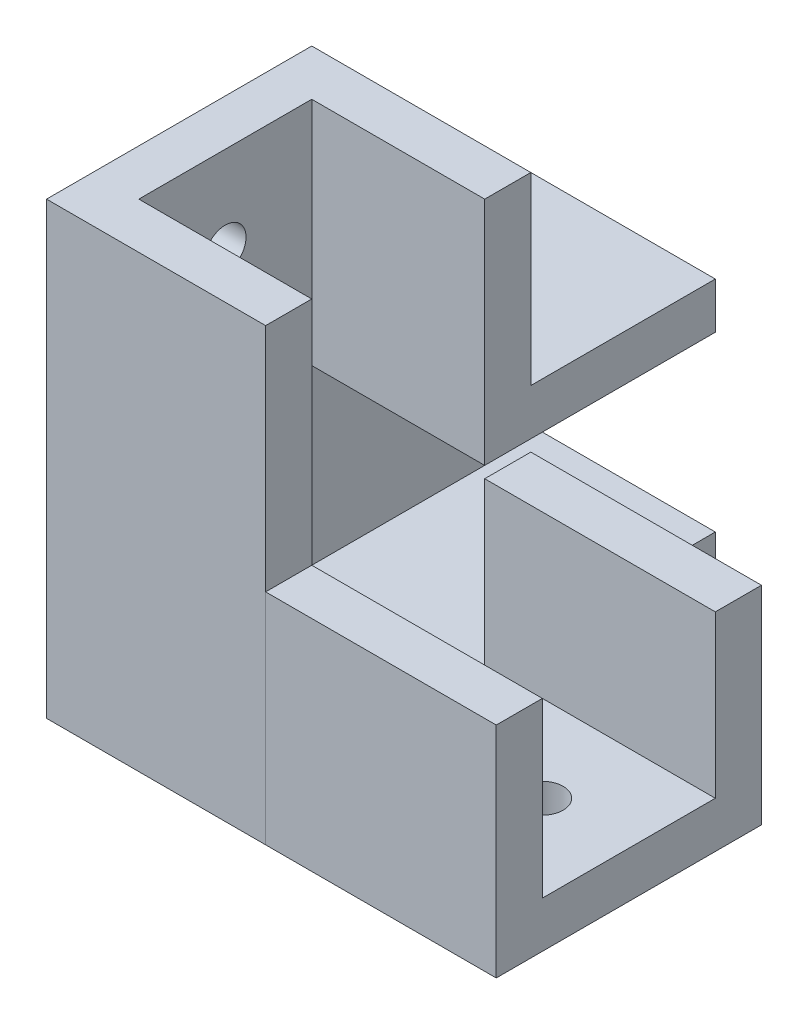
ISO-10303-21;
HEADER;
FILE_DESCRIPTION(('STEP AP214'),'2;1');
FILE_NAME('part.step','',(''),(''),'','','');
FILE_SCHEMA(('AUTOMOTIVE_DESIGN { 1 0 10303 214 1 1 1 1 }'));
ENDSEC;
DATA;
#1=APPLICATION_CONTEXT('core data for automotive mechanical design processes');
#2=APPLICATION_PROTOCOL_DEFINITION('international standard','automotive_design',2000,#1);
#3=PRODUCT_CONTEXT('',#1,'mechanical');
#4=PRODUCT('Part','Part','',(#3));
#5=PRODUCT_RELATED_PRODUCT_CATEGORY('part','',(#4));
#6=PRODUCT_DEFINITION_FORMATION('','',#4);
#7=PRODUCT_DEFINITION_CONTEXT('part definition',#1,'design');
#8=PRODUCT_DEFINITION('design','',#6,#7);
#9=PRODUCT_DEFINITION_SHAPE('','',#8);
#10=(LENGTH_UNIT() NAMED_UNIT(*) SI_UNIT(.MILLI.,.METRE.));
#11=(NAMED_UNIT(*) PLANE_ANGLE_UNIT() SI_UNIT($,.RADIAN.));
#12=(NAMED_UNIT(*) SI_UNIT($,.STERADIAN.) SOLID_ANGLE_UNIT());
#13=UNCERTAINTY_MEASURE_WITH_UNIT(LENGTH_MEASURE(1.E-05),#10,'distance_accuracy_value','');
#14=(GEOMETRIC_REPRESENTATION_CONTEXT(3) GLOBAL_UNCERTAINTY_ASSIGNED_CONTEXT((#13)) GLOBAL_UNIT_ASSIGNED_CONTEXT((#10,
#11,#12)) REPRESENTATION_CONTEXT('',''));
#15=CARTESIAN_POINT('',(0.,0.,0.));
#16=DIRECTION('',(0.,0.,1.));
#17=DIRECTION('',(1.,0.,0.));
#18=AXIS2_PLACEMENT_3D('',#15,#16,#17);
#19=CARTESIAN_POINT('',(35.,0.,0.));
#20=DIRECTION('',(0.,1.,0.));
#21=DIRECTION('',(0.,0.,1.));
#22=AXIS2_PLACEMENT_3D('',#19,#20,#21);
#23=PLANE('',#22);
#24=CARTESIAN_POINT('',(27.5,0.,7.5));
#25=DIRECTION('',(0.,-1.,0.));
#26=DIRECTION('',(0.,0.,-1.));
#27=AXIS2_PLACEMENT_3D('',#24,#25,#26);
#28=CIRCLE('',#27,1.8);
#29=CARTESIAN_POINT('',(27.5,0.,5.7));
#30=VERTEX_POINT('',#29);
#31=EDGE_CURVE('E194',#30,#30,#28,.T.);
#32=ORIENTED_EDGE('',*,*,#31,.F.);
#33=EDGE_LOOP('',(#32));
#34=FACE_BOUND('',#33,.T.);
#35=DIRECTION('',(0.,0.,-1.));
#36=VECTOR('',#35,1.);
#37=CARTESIAN_POINT('',(15.,0.,0.));
#38=LINE('',#37,#36);
#39=CARTESIAN_POINT('',(15.,0.,19.));
#40=VERTEX_POINT('',#39);
#41=CARTESIAN_POINT('',(15.,0.,-4.));
#42=VERTEX_POINT('',#41);
#43=EDGE_CURVE('E147',#40,#42,#38,.T.);
#44=ORIENTED_EDGE('',*,*,#43,.T.);
#45=DIRECTION('',(-1.,0.,0.));
#46=VECTOR('',#45,1.);
#47=CARTESIAN_POINT('',(35.,0.,-4.));
#48=LINE('',#47,#46);
#49=CARTESIAN_POINT('',(35.,0.,-4.));
#50=VERTEX_POINT('',#49);
#51=EDGE_CURVE('E12',#50,#42,#48,.T.);
#52=ORIENTED_EDGE('',*,*,#51,.F.);
#53=DIRECTION('',(0.,0.,-1.));
#54=VECTOR('',#53,1.);
#55=CARTESIAN_POINT('',(35.,0.,0.));
#56=LINE('',#55,#54);
#57=CARTESIAN_POINT('',(35.,0.,19.));
#58=VERTEX_POINT('',#57);
#59=EDGE_CURVE('E164',#58,#50,#56,.T.);
#60=ORIENTED_EDGE('',*,*,#59,.F.);
#61=DIRECTION('',(-1.,0.,0.));
#62=VECTOR('',#61,1.);
#63=CARTESIAN_POINT('',(35.,0.,19.));
#64=LINE('',#63,#62);
#65=EDGE_CURVE('E143',#58,#40,#64,.T.);
#66=ORIENTED_EDGE('',*,*,#65,.T.);
#67=EDGE_LOOP('',(#44,#52,#60,#66));
#68=FACE_BOUND('',#67,.T.);
#69=ADVANCED_FACE('F49',(#34,#68),#23,.F.);
#70=CARTESIAN_POINT('',(35.,0.,-4.));
#71=DIRECTION('',(0.,0.,1.));
#72=DIRECTION('',(1.,0.,0.));
#73=AXIS2_PLACEMENT_3D('',#70,#71,#72);
#74=PLANE('',#73);
#75=DIRECTION('',(0.,1.,0.));
#76=VECTOR('',#75,1.);
#77=CARTESIAN_POINT('',(15.,0.,-4.));
#78=LINE('',#77,#76);
#79=CARTESIAN_POINT('',(15.,18.,-4.));
#80=VERTEX_POINT('',#79);
#81=EDGE_CURVE('E150',#42,#80,#78,.T.);
#82=ORIENTED_EDGE('',*,*,#81,.T.);
#83=DIRECTION('',(-1.,0.,0.));
#84=VECTOR('',#83,1.);
#85=CARTESIAN_POINT('',(35.,18.,-4.));
#86=LINE('',#85,#84);
#87=CARTESIAN_POINT('',(35.,18.,-4.));
#88=VERTEX_POINT('',#87);
#89=EDGE_CURVE('E58',#88,#80,#86,.T.);
#90=ORIENTED_EDGE('',*,*,#89,.F.);
#91=DIRECTION('',(0.,1.,0.));
#92=VECTOR('',#91,1.);
#93=CARTESIAN_POINT('',(35.,0.,-4.));
#94=LINE('',#93,#92);
#95=EDGE_CURVE('E109',#50,#88,#94,.T.);
#96=ORIENTED_EDGE('',*,*,#95,.F.);
#97=ORIENTED_EDGE('',*,*,#51,.T.);
#98=EDGE_LOOP('',(#82,#90,#96,#97));
#99=FACE_BOUND('',#98,.T.);
#100=ADVANCED_FACE('F178',(#99),#74,.F.);
#101=CARTESIAN_POINT('',(35.,18.,0.));
#102=DIRECTION('',(0.,1.,0.));
#103=DIRECTION('',(0.,0.,1.));
#104=AXIS2_PLACEMENT_3D('',#101,#102,#103);
#105=PLANE('',#104);
#106=DIRECTION('',(0.,0.,-1.));
#107=VECTOR('',#106,1.);
#108=CARTESIAN_POINT('',(15.,18.,0.));
#109=LINE('',#108,#107);
#110=CARTESIAN_POINT('',(15.,18.,0.));
#111=VERTEX_POINT('',#110);
#112=EDGE_CURVE('E153',#111,#80,#109,.T.);
#113=ORIENTED_EDGE('',*,*,#112,.F.);
#114=DIRECTION('',(-1.,0.,0.));
#115=VECTOR('',#114,1.);
#116=CARTESIAN_POINT('',(35.,18.,0.));
#117=LINE('',#116,#115);
#118=CARTESIAN_POINT('',(35.,18.,0.));
#119=VERTEX_POINT('',#118);
#120=EDGE_CURVE('E170',#119,#111,#117,.T.);
#121=ORIENTED_EDGE('',*,*,#120,.F.);
#122=DIRECTION('',(0.,0.,-1.));
#123=VECTOR('',#122,1.);
#124=CARTESIAN_POINT('',(35.,18.,0.));
#125=LINE('',#124,#123);
#126=EDGE_CURVE('E177',#119,#88,#125,.T.);
#127=ORIENTED_EDGE('',*,*,#126,.T.);
#128=ORIENTED_EDGE('',*,*,#89,.T.);
#129=EDGE_LOOP('',(#113,#121,#127,#128));
#130=FACE_BOUND('',#129,.T.);
#131=ADVANCED_FACE('F175',(#130),#105,.T.);
#132=CARTESIAN_POINT('',(35.,0.,0.));
#133=DIRECTION('',(0.,0.,1.));
#134=DIRECTION('',(1.,0.,0.));
#135=AXIS2_PLACEMENT_3D('',#132,#133,#134);
#136=PLANE('',#135);
#137=DIRECTION('',(0.,1.,0.));
#138=VECTOR('',#137,1.);
#139=CARTESIAN_POINT('',(15.,0.,0.));
#140=LINE('',#139,#138);
#141=CARTESIAN_POINT('',(15.,4.,0.));
#142=VERTEX_POINT('',#141);
#143=EDGE_CURVE('E156',#142,#111,#140,.T.);
#144=ORIENTED_EDGE('',*,*,#143,.F.);
#145=DIRECTION('',(-1.,0.,0.));
#146=VECTOR('',#145,1.);
#147=CARTESIAN_POINT('',(35.,4.,0.));
#148=LINE('',#147,#146);
#149=CARTESIAN_POINT('',(35.,4.,0.));
#150=VERTEX_POINT('',#149);
#151=EDGE_CURVE('E168',#150,#142,#148,.T.);
#152=ORIENTED_EDGE('',*,*,#151,.F.);
#153=DIRECTION('',(0.,1.,0.));
#154=VECTOR('',#153,1.);
#155=CARTESIAN_POINT('',(35.,0.,0.));
#156=LINE('',#155,#154);
#157=EDGE_CURVE('E188',#150,#119,#156,.T.);
#158=ORIENTED_EDGE('',*,*,#157,.T.);
#159=ORIENTED_EDGE('',*,*,#120,.T.);
#160=EDGE_LOOP('',(#144,#152,#158,#159));
#161=FACE_BOUND('',#160,.T.);
#162=ADVANCED_FACE('F186',(#161),#136,.T.);
#163=CARTESIAN_POINT('',(35.,4.,0.));
#164=DIRECTION('',(0.,-1.,0.));
#165=DIRECTION('',(0.,0.,-1.));
#166=AXIS2_PLACEMENT_3D('',#163,#164,#165);
#167=PLANE('',#166);
#168=CARTESIAN_POINT('',(27.5,4.,7.5));
#169=DIRECTION('',(0.,-1.,0.));
#170=DIRECTION('',(0.,0.,-1.));
#171=AXIS2_PLACEMENT_3D('',#168,#169,#170);
#172=CIRCLE('',#171,1.8);
#173=CARTESIAN_POINT('',(27.5,4.,5.7));
#174=VERTEX_POINT('',#173);
#175=EDGE_CURVE('E52',#174,#174,#172,.T.);
#176=ORIENTED_EDGE('',*,*,#175,.T.);
#177=EDGE_LOOP('',(#176));
#178=FACE_BOUND('',#177,.T.);
#179=DIRECTION('',(0.,0.,1.));
#180=VECTOR('',#179,1.);
#181=CARTESIAN_POINT('',(15.,4.,0.));
#182=LINE('',#181,#180);
#183=CARTESIAN_POINT('',(15.,4.,15.));
#184=VERTEX_POINT('',#183);
#185=EDGE_CURVE('E159',#142,#184,#182,.T.);
#186=ORIENTED_EDGE('',*,*,#185,.T.);
#187=DIRECTION('',(-1.,0.,0.));
#188=VECTOR('',#187,1.);
#189=CARTESIAN_POINT('',(35.,4.,15.));
#190=LINE('',#189,#188);
#191=CARTESIAN_POINT('',(35.,4.,15.));
#192=VERTEX_POINT('',#191);
#193=EDGE_CURVE('E138',#192,#184,#190,.T.);
#194=ORIENTED_EDGE('',*,*,#193,.F.);
#195=DIRECTION('',(0.,0.,1.));
#196=VECTOR('',#195,1.);
#197=CARTESIAN_POINT('',(35.,4.,0.));
#198=LINE('',#197,#196);
#199=EDGE_CURVE('E129',#150,#192,#198,.T.);
#200=ORIENTED_EDGE('',*,*,#199,.F.);
#201=ORIENTED_EDGE('',*,*,#151,.T.);
#202=EDGE_LOOP('',(#186,#194,#200,#201));
#203=FACE_BOUND('',#202,.T.);
#204=ADVANCED_FACE('F201',(#178,#203),#167,.F.);
#205=CARTESIAN_POINT('',(35.,0.,15.));
#206=DIRECTION('',(0.,0.,1.));
#207=DIRECTION('',(1.,0.,0.));
#208=AXIS2_PLACEMENT_3D('',#205,#206,#207);
#209=PLANE('',#208);
#210=DIRECTION('',(0.,1.,0.));
#211=VECTOR('',#210,1.);
#212=CARTESIAN_POINT('',(15.,0.,15.));
#213=LINE('',#212,#211);
#214=CARTESIAN_POINT('',(15.,19.,15.));
#215=VERTEX_POINT('',#214);
#216=EDGE_CURVE('E137',#184,#215,#213,.T.);
#217=ORIENTED_EDGE('',*,*,#216,.T.);
#218=DIRECTION('',(-1.,0.,0.));
#219=VECTOR('',#218,1.);
#220=CARTESIAN_POINT('',(35.,19.,15.));
#221=LINE('',#220,#219);
#222=CARTESIAN_POINT('',(35.,19.,15.));
#223=VERTEX_POINT('',#222);
#224=EDGE_CURVE('E134',#223,#215,#221,.T.);
#225=ORIENTED_EDGE('',*,*,#224,.F.);
#226=DIRECTION('',(0.,1.,0.));
#227=VECTOR('',#226,1.);
#228=CARTESIAN_POINT('',(35.,0.,15.));
#229=LINE('',#228,#227);
#230=EDGE_CURVE('E122',#192,#223,#229,.T.);
#231=ORIENTED_EDGE('',*,*,#230,.F.);
#232=ORIENTED_EDGE('',*,*,#193,.T.);
#233=EDGE_LOOP('',(#217,#225,#231,#232));
#234=FACE_BOUND('',#233,.T.);
#235=ADVANCED_FACE('F135',(#234),#209,.F.);
#236=CARTESIAN_POINT('',(35.,19.,0.));
#237=DIRECTION('',(0.,-1.,0.));
#238=DIRECTION('',(0.,0.,-1.));
#239=AXIS2_PLACEMENT_3D('',#236,#237,#238);
#240=PLANE('',#239);
#241=DIRECTION('',(0.,0.,1.));
#242=VECTOR('',#241,1.);
#243=CARTESIAN_POINT('',(15.,19.,0.));
#244=LINE('',#243,#242);
#245=CARTESIAN_POINT('',(15.,19.,19.));
#246=VERTEX_POINT('',#245);
#247=EDGE_CURVE('E95',#215,#246,#244,.T.);
#248=ORIENTED_EDGE('',*,*,#247,.T.);
#249=DIRECTION('',(-1.,0.,0.));
#250=VECTOR('',#249,1.);
#251=CARTESIAN_POINT('',(35.,19.,19.));
#252=LINE('',#251,#250);
#253=CARTESIAN_POINT('',(35.,19.,19.));
#254=VERTEX_POINT('',#253);
#255=EDGE_CURVE('E139',#254,#246,#252,.T.);
#256=ORIENTED_EDGE('',*,*,#255,.F.);
#257=DIRECTION('',(0.,0.,1.));
#258=VECTOR('',#257,1.);
#259=CARTESIAN_POINT('',(35.,19.,0.));
#260=LINE('',#259,#258);
#261=EDGE_CURVE('E126',#223,#254,#260,.T.);
#262=ORIENTED_EDGE('',*,*,#261,.F.);
#263=ORIENTED_EDGE('',*,*,#224,.T.);
#264=EDGE_LOOP('',(#248,#256,#262,#263));
#265=FACE_BOUND('',#264,.T.);
#266=ADVANCED_FACE('F141',(#265),#240,.F.);
#267=CARTESIAN_POINT('',(35.,0.,19.));
#268=DIRECTION('',(0.,0.,-1.));
#269=DIRECTION('',(-1.,0.,0.));
#270=AXIS2_PLACEMENT_3D('',#267,#268,#269);
#271=PLANE('',#270);
#272=DIRECTION('',(0.,-1.,0.));
#273=VECTOR('',#272,1.);
#274=CARTESIAN_POINT('',(15.,0.,19.));
#275=LINE('',#274,#273);
#276=EDGE_CURVE('E101',#246,#40,#275,.T.);
#277=ORIENTED_EDGE('',*,*,#276,.T.);
#278=ORIENTED_EDGE('',*,*,#65,.F.);
#279=DIRECTION('',(0.,-1.,0.));
#280=VECTOR('',#279,1.);
#281=CARTESIAN_POINT('',(35.,0.,19.));
#282=LINE('',#281,#280);
#283=EDGE_CURVE('E66',#254,#58,#282,.T.);
#284=ORIENTED_EDGE('',*,*,#283,.F.);
#285=ORIENTED_EDGE('',*,*,#255,.T.);
#286=EDGE_LOOP('',(#277,#278,#284,#285));
#287=FACE_BOUND('',#286,.T.);
#288=ADVANCED_FACE('F219',(#287),#271,.F.);
#289=CARTESIAN_POINT('',(35.,0.,0.));
#290=DIRECTION('',(1.,0.,0.));
#291=DIRECTION('',(0.,0.,-1.));
#292=AXIS2_PLACEMENT_3D('',#289,#290,#291);
#293=PLANE('',#292);
#294=ORIENTED_EDGE('',*,*,#59,.T.);
#295=ORIENTED_EDGE('',*,*,#95,.T.);
#296=ORIENTED_EDGE('',*,*,#126,.F.);
#297=ORIENTED_EDGE('',*,*,#157,.F.);
#298=ORIENTED_EDGE('',*,*,#199,.T.);
#299=ORIENTED_EDGE('',*,*,#230,.T.);
#300=ORIENTED_EDGE('',*,*,#261,.T.);
#301=ORIENTED_EDGE('',*,*,#283,.T.);
#302=EDGE_LOOP('',(#294,#295,#296,#297,#298,#299,#300,#301));
#303=FACE_BOUND('',#302,.T.);
#304=ADVANCED_FACE('F124',(#303),#293,.T.);
#305=CARTESIAN_POINT('',(15.,0.,0.));
#306=DIRECTION('',(1.,0.,0.));
#307=DIRECTION('',(0.,0.,-1.));
#308=AXIS2_PLACEMENT_3D('',#305,#306,#307);
#309=PLANE('',#308);
#310=ORIENTED_EDGE('',*,*,#43,.F.);
#311=ORIENTED_EDGE('',*,*,#276,.F.);
#312=ORIENTED_EDGE('',*,*,#247,.F.);
#313=ORIENTED_EDGE('',*,*,#216,.F.);
#314=ORIENTED_EDGE('',*,*,#185,.F.);
#315=ORIENTED_EDGE('',*,*,#143,.T.);
#316=ORIENTED_EDGE('',*,*,#112,.T.);
#317=ORIENTED_EDGE('',*,*,#81,.F.);
#318=EDGE_LOOP('',(#310,#311,#312,#313,#314,#315,#316,#317));
#319=FACE_BOUND('',#318,.T.);
#320=ADVANCED_FACE('F182',(#319),#309,.F.);
#321=CARTESIAN_POINT('',(27.5,12.,7.5));
#322=DIRECTION('',(0.,-1.,0.));
#323=DIRECTION('',(0.,0.,-1.));
#324=AXIS2_PLACEMENT_3D('',#321,#322,#323);
#325=CYLINDRICAL_SURFACE('',#324,1.8);
#326=ORIENTED_EDGE('',*,*,#31,.T.);
#327=EDGE_LOOP('',(#326));
#328=FACE_BOUND('',#327,.T.);
#329=ORIENTED_EDGE('',*,*,#175,.F.);
#330=EDGE_LOOP('',(#329));
#331=FACE_BOUND('',#330,.T.);
#332=ADVANCED_FACE('F204',(#328,#331),#325,.F.);
#333=CLOSED_SHELL('',(#69,#100,#131,#162,#204,#235,#266,#288,#304,#320,#332));
#334=MANIFOLD_SOLID_BREP('B2',#333);
#335=CARTESIAN_POINT('',(0.,0.,0.));
#336=DIRECTION('',(0.,0.,-1.));
#337=DIRECTION('',(-1.,0.,0.));
#338=AXIS2_PLACEMENT_3D('',#335,#336,#337);
#339=PLANE('',#338);
#340=DIRECTION('',(0.,-1.,0.));
#341=VECTOR('',#340,1.);
#342=CARTESIAN_POINT('',(0.,39.,0.));
#343=LINE('',#342,#341);
#344=CARTESIAN_POINT('',(0.,39.,0.));
#345=VERTEX_POINT('',#344);
#346=CARTESIAN_POINT('',(0.,19.,0.));
#347=VERTEX_POINT('',#346);
#348=EDGE_CURVE('E352',#345,#347,#343,.T.);
#349=ORIENTED_EDGE('',*,*,#348,.T.);
#350=DIRECTION('',(1.,0.,0.));
#351=VECTOR('',#350,1.);
#352=CARTESIAN_POINT('',(0.,19.,0.));
#353=LINE('',#352,#351);
#354=CARTESIAN_POINT('',(15.,19.,0.));
#355=VERTEX_POINT('',#354);
#356=EDGE_CURVE('E481',#347,#355,#353,.T.);
#357=ORIENTED_EDGE('',*,*,#356,.T.);
#358=DIRECTION('',(0.,1.,0.));
#359=VECTOR('',#358,1.);
#360=CARTESIAN_POINT('',(15.,0.,0.));
#361=LINE('',#360,#359);
#362=CARTESIAN_POINT('',(15.,39.,0.));
#363=VERTEX_POINT('',#362);
#364=EDGE_CURVE('E476',#355,#363,#361,.T.);
#365=ORIENTED_EDGE('',*,*,#364,.T.);
#366=DIRECTION('',(1.,0.,0.));
#367=VECTOR('',#366,1.);
#368=CARTESIAN_POINT('',(-3.99999999999999,39.,0.));
#369=LINE('',#368,#367);
#370=EDGE_CURVE('E449',#345,#363,#369,.T.);
#371=ORIENTED_EDGE('',*,*,#370,.F.);
#372=EDGE_LOOP('',(#349,#357,#365,#371));
#373=FACE_BOUND('',#372,.T.);
#374=ADVANCED_FACE('F337',(#373),#339,.F.);
#375=CARTESIAN_POINT('',(0.,23.,-20.));
#376=DIRECTION('',(0.,-1.,0.));
#377=DIRECTION('',(1.,0.,0.));
#378=AXIS2_PLACEMENT_3D('',#375,#376,#377);
#379=PLANE('',#378);
#380=DIRECTION('',(-1.,0.,0.));
#381=VECTOR('',#380,1.);
#382=CARTESIAN_POINT('',(-4.,23.,-4.));
#383=LINE('',#382,#381);
#384=CARTESIAN_POINT('',(15.,23.,-4.));
#385=VERTEX_POINT('',#384);
#386=CARTESIAN_POINT('',(-4.,23.,-4.));
#387=VERTEX_POINT('',#386);
#388=EDGE_CURVE('E360',#385,#387,#383,.T.);
#389=ORIENTED_EDGE('',*,*,#388,.F.);
#390=DIRECTION('',(0.,0.,1.));
#391=VECTOR('',#390,1.);
#392=CARTESIAN_POINT('',(15.,23.,-20.));
#393=LINE('',#392,#391);
#394=CARTESIAN_POINT('',(15.,23.,-20.));
#395=VERTEX_POINT('',#394);
#396=EDGE_CURVE('E500',#395,#385,#393,.T.);
#397=ORIENTED_EDGE('',*,*,#396,.F.);
#398=DIRECTION('',(1.,0.,0.));
#399=VECTOR('',#398,1.);
#400=CARTESIAN_POINT('',(0.,23.,-20.));
#401=LINE('',#400,#399);
#402=CARTESIAN_POINT('',(-4.,23.,-20.));
#403=VERTEX_POINT('',#402);
#404=EDGE_CURVE('E498',#403,#395,#401,.T.);
#405=ORIENTED_EDGE('',*,*,#404,.F.);
#406=DIRECTION('',(0.,0.,1.));
#407=VECTOR('',#406,1.);
#408=CARTESIAN_POINT('',(-4.,23.,-20.));
#409=LINE('',#408,#407);
#410=EDGE_CURVE('E506',#403,#387,#409,.T.);
#411=ORIENTED_EDGE('',*,*,#410,.T.);
#412=EDGE_LOOP('',(#389,#397,#405,#411));
#413=FACE_BOUND('',#412,.T.);
#414=ADVANCED_FACE('F545',(#413),#379,.F.);
#415=CARTESIAN_POINT('',(0.,0.,15.));
#416=DIRECTION('',(1.,0.,0.));
#417=DIRECTION('',(0.,1.,0.));
#418=AXIS2_PLACEMENT_3D('',#415,#416,#417);
#419=PLANE('',#418);
#420=CARTESIAN_POINT('',(0.,31.5,7.5));
#421=DIRECTION('',(1.,0.,0.));
#422=DIRECTION('',(0.,1.,0.));
#423=AXIS2_PLACEMENT_3D('',#420,#421,#422);
#424=CIRCLE('',#423,1.8);
#425=CARTESIAN_POINT('',(0.,33.3,7.5));
#426=VERTEX_POINT('',#425);
#427=EDGE_CURVE('E459',#426,#426,#424,.T.);
#428=ORIENTED_EDGE('',*,*,#427,.F.);
#429=EDGE_LOOP('',(#428));
#430=FACE_BOUND('',#429,.T.);
#431=CARTESIAN_POINT('',(0.,10.5,-12.5));
#432=DIRECTION('',(1.,0.,0.));
#433=DIRECTION('',(0.,1.,0.));
#434=AXIS2_PLACEMENT_3D('',#431,#432,#433);
#435=CIRCLE('',#434,1.8);
#436=CARTESIAN_POINT('',(0.,12.3,-12.5));
#437=VERTEX_POINT('',#436);
#438=EDGE_CURVE('E608',#437,#437,#435,.T.);
#439=ORIENTED_EDGE('',*,*,#438,.F.);
#440=EDGE_LOOP('',(#439));
#441=FACE_BOUND('',#440,.T.);
#442=DIRECTION('',(0.,0.,-1.));
#443=VECTOR('',#442,1.);
#444=CARTESIAN_POINT('',(0.,4.,15.));
#445=LINE('',#444,#443);
#446=CARTESIAN_POINT('',(0.,4.,15.));
#447=VERTEX_POINT('',#446);
#448=CARTESIAN_POINT('',(0.,4.,-20.));
#449=VERTEX_POINT('',#448);
#450=EDGE_CURVE('E521',#447,#449,#445,.T.);
#451=ORIENTED_EDGE('',*,*,#450,.T.);
#452=DIRECTION('',(0.,-1.,0.));
#453=VECTOR('',#452,1.);
#454=CARTESIAN_POINT('',(0.,0.,-20.));
#455=LINE('',#454,#453);
#456=CARTESIAN_POINT('',(0.,19.,-20.));
#457=VERTEX_POINT('',#456);
#458=EDGE_CURVE('E484',#457,#449,#455,.T.);
#459=ORIENTED_EDGE('',*,*,#458,.F.);
#460=DIRECTION('',(0.,0.,1.));
#461=VECTOR('',#460,1.);
#462=CARTESIAN_POINT('',(0.,19.,-20.));
#463=LINE('',#462,#461);
#464=EDGE_CURVE('E508',#457,#347,#463,.T.);
#465=ORIENTED_EDGE('',*,*,#464,.T.);
#466=ORIENTED_EDGE('',*,*,#348,.F.);
#467=DIRECTION('',(0.,0.,-1.));
#468=VECTOR('',#467,1.);
#469=CARTESIAN_POINT('',(0.,39.,0.));
#470=LINE('',#469,#468);
#471=CARTESIAN_POINT('',(0.,39.,15.));
#472=VERTEX_POINT('',#471);
#473=EDGE_CURVE('E455',#472,#345,#470,.T.);
#474=ORIENTED_EDGE('',*,*,#473,.F.);
#475=DIRECTION('',(0.,-1.,0.));
#476=VECTOR('',#475,1.);
#477=CARTESIAN_POINT('',(0.,0.,15.));
#478=LINE('',#477,#476);
#479=EDGE_CURVE('E514',#472,#447,#478,.T.);
#480=ORIENTED_EDGE('',*,*,#479,.T.);
#481=EDGE_LOOP('',(#451,#459,#465,#466,#474,#480));
#482=FACE_BOUND('',#481,.T.);
#483=ADVANCED_FACE('F339',(#430,#441,#482),#419,.T.);
#484=CARTESIAN_POINT('',(-4.,0.,15.));
#485=DIRECTION('',(1.,0.,0.));
#486=DIRECTION('',(0.,1.,0.));
#487=AXIS2_PLACEMENT_3D('',#484,#485,#486);
#488=PLANE('',#487);
#489=CARTESIAN_POINT('',(-4.,31.5,7.5));
#490=DIRECTION('',(-1.,0.,0.));
#491=DIRECTION('',(0.,-1.,0.));
#492=AXIS2_PLACEMENT_3D('',#489,#490,#491);
#493=CIRCLE('',#492,1.8);
#494=CARTESIAN_POINT('',(-4.,29.7,7.5));
#495=VERTEX_POINT('',#494);
#496=EDGE_CURVE('E607',#495,#495,#493,.T.);
#497=ORIENTED_EDGE('',*,*,#496,.F.);
#498=EDGE_LOOP('',(#497));
#499=FACE_BOUND('',#498,.T.);
#500=CARTESIAN_POINT('',(-4.,10.5,-12.5));
#501=DIRECTION('',(-1.,0.,0.));
#502=DIRECTION('',(0.,-1.,0.));
#503=AXIS2_PLACEMENT_3D('',#500,#501,#502);
#504=CIRCLE('',#503,1.8);
#505=CARTESIAN_POINT('',(-4.,8.7,-12.5));
#506=VERTEX_POINT('',#505);
#507=EDGE_CURVE('E609',#506,#506,#504,.T.);
#508=ORIENTED_EDGE('',*,*,#507,.F.);
#509=EDGE_LOOP('',(#508));
#510=FACE_BOUND('',#509,.T.);
#511=DIRECTION('',(0.,-1.,0.));
#512=VECTOR('',#511,1.);
#513=CARTESIAN_POINT('',(-4.,19.,19.));
#514=LINE('',#513,#512);
#515=CARTESIAN_POINT('',(-4.,39.,19.));
#516=VERTEX_POINT('',#515);
#517=CARTESIAN_POINT('',(-4.,0.,19.));
#518=VERTEX_POINT('',#517);
#519=EDGE_CURVE('E427',#516,#518,#514,.T.);
#520=ORIENTED_EDGE('',*,*,#519,.F.);
#521=DIRECTION('',(0.,0.,1.));
#522=VECTOR('',#521,1.);
#523=CARTESIAN_POINT('',(-3.99999999999999,39.,0.));
#524=LINE('',#523,#522);
#525=CARTESIAN_POINT('',(-3.99999999999999,39.,-4.));
#526=VERTEX_POINT('',#525);
#527=EDGE_CURVE('E431',#526,#516,#524,.T.);
#528=ORIENTED_EDGE('',*,*,#527,.F.);
#529=DIRECTION('',(0.,-1.,0.));
#530=VECTOR('',#529,1.);
#531=CARTESIAN_POINT('',(-3.99999999999999,39.,-4.));
#532=LINE('',#531,#530);
#533=EDGE_CURVE('E470',#526,#387,#532,.T.);
#534=ORIENTED_EDGE('',*,*,#533,.T.);
#535=ORIENTED_EDGE('',*,*,#410,.F.);
#536=DIRECTION('',(0.,1.,0.));
#537=VECTOR('',#536,1.);
#538=CARTESIAN_POINT('',(-4.,0.,-20.));
#539=LINE('',#538,#537);
#540=CARTESIAN_POINT('',(-4.,0.,-20.));
#541=VERTEX_POINT('',#540);
#542=EDGE_CURVE('E496',#541,#403,#539,.T.);
#543=ORIENTED_EDGE('',*,*,#542,.F.);
#544=DIRECTION('',(0.,0.,-1.));
#545=VECTOR('',#544,1.);
#546=CARTESIAN_POINT('',(-4.,0.,15.));
#547=LINE('',#546,#545);
#548=EDGE_CURVE('E47',#518,#541,#547,.T.);
#549=ORIENTED_EDGE('',*,*,#548,.F.);
#550=EDGE_LOOP('',(#520,#528,#534,#535,#543,#549));
#551=FACE_BOUND('',#550,.T.);
#552=ADVANCED_FACE('F429',(#499,#510,#551),#488,.F.);
#553=CARTESIAN_POINT('',(0.,0.,15.));
#554=DIRECTION('',(0.,1.,0.));
#555=DIRECTION('',(0.,0.,1.));
#556=AXIS2_PLACEMENT_3D('',#553,#554,#555);
#557=PLANE('',#556);
#558=ORIENTED_EDGE('',*,*,#548,.T.);
#559=DIRECTION('',(-1.,0.,0.));
#560=VECTOR('',#559,1.);
#561=CARTESIAN_POINT('',(0.,0.,-20.));
#562=LINE('',#561,#560);
#563=CARTESIAN_POINT('',(15.,0.,-20.));
#564=VERTEX_POINT('',#563);
#565=EDGE_CURVE('E493',#564,#541,#562,.T.);
#566=ORIENTED_EDGE('',*,*,#565,.F.);
#567=DIRECTION('',(0.,0.,-1.));
#568=VECTOR('',#567,1.);
#569=CARTESIAN_POINT('',(15.,0.,15.));
#570=LINE('',#569,#568);
#571=CARTESIAN_POINT('',(15.,0.,19.));
#572=VERTEX_POINT('',#571);
#573=EDGE_CURVE('E345',#572,#564,#570,.T.);
#574=ORIENTED_EDGE('',*,*,#573,.F.);
#575=DIRECTION('',(1.,0.,0.));
#576=VECTOR('',#575,1.);
#577=CARTESIAN_POINT('',(-4.,0.,19.));
#578=LINE('',#577,#576);
#579=EDGE_CURVE('E437',#518,#572,#578,.T.);
#580=ORIENTED_EDGE('',*,*,#579,.F.);
#581=EDGE_LOOP('',(#558,#566,#574,#580));
#582=FACE_BOUND('',#581,.T.);
#583=ADVANCED_FACE('F534',(#582),#557,.F.);
#584=CARTESIAN_POINT('',(15.,0.,15.));
#585=DIRECTION('',(-1.,0.,0.));
#586=DIRECTION('',(0.,0.,1.));
#587=AXIS2_PLACEMENT_3D('',#584,#585,#586);
#588=PLANE('',#587);
#589=ORIENTED_EDGE('',*,*,#573,.T.);
#590=DIRECTION('',(0.,-1.,0.));
#591=VECTOR('',#590,1.);
#592=CARTESIAN_POINT('',(15.,0.,-20.));
#593=LINE('',#592,#591);
#594=CARTESIAN_POINT('',(15.,4.,-20.));
#595=VERTEX_POINT('',#594);
#596=EDGE_CURVE('E490',#595,#564,#593,.T.);
#597=ORIENTED_EDGE('',*,*,#596,.F.);
#598=DIRECTION('',(0.,0.,-1.));
#599=VECTOR('',#598,1.);
#600=CARTESIAN_POINT('',(15.,4.,15.));
#601=LINE('',#600,#599);
#602=CARTESIAN_POINT('',(15.,4.,15.));
#603=VERTEX_POINT('',#602);
#604=EDGE_CURVE('E523',#603,#595,#601,.T.);
#605=ORIENTED_EDGE('',*,*,#604,.F.);
#606=DIRECTION('',(0.,1.,0.));
#607=VECTOR('',#606,1.);
#608=CARTESIAN_POINT('',(15.,19.,15.));
#609=LINE('',#608,#607);
#610=CARTESIAN_POINT('',(15.,39.,15.));
#611=VERTEX_POINT('',#610);
#612=EDGE_CURVE('E438',#603,#611,#609,.T.);
#613=ORIENTED_EDGE('',*,*,#612,.T.);
#614=DIRECTION('',(0.,0.,-1.));
#615=VECTOR('',#614,1.);
#616=CARTESIAN_POINT('',(15.,39.,0.));
#617=LINE('',#616,#615);
#618=CARTESIAN_POINT('',(15.,39.,19.));
#619=VERTEX_POINT('',#618);
#620=EDGE_CURVE('E454',#619,#611,#617,.T.);
#621=ORIENTED_EDGE('',*,*,#620,.F.);
#622=DIRECTION('',(0.,1.,0.));
#623=VECTOR('',#622,1.);
#624=CARTESIAN_POINT('',(15.,19.,19.));
#625=LINE('',#624,#623);
#626=EDGE_CURVE('E453',#572,#619,#625,.T.);
#627=ORIENTED_EDGE('',*,*,#626,.F.);
#628=EDGE_LOOP('',(#589,#597,#605,#613,#621,#627));
#629=FACE_BOUND('',#628,.T.);
#630=ADVANCED_FACE('F526',(#629),#588,.F.);
#631=CARTESIAN_POINT('',(0.,4.,15.));
#632=DIRECTION('',(0.,1.,0.));
#633=DIRECTION('',(0.,0.,1.));
#634=AXIS2_PLACEMENT_3D('',#631,#632,#633);
#635=PLANE('',#634);
#636=ORIENTED_EDGE('',*,*,#604,.T.);
#637=DIRECTION('',(1.,0.,0.));
#638=VECTOR('',#637,1.);
#639=CARTESIAN_POINT('',(0.,4.,-20.));
#640=LINE('',#639,#638);
#641=EDGE_CURVE('E487',#449,#595,#640,.T.);
#642=ORIENTED_EDGE('',*,*,#641,.F.);
#643=ORIENTED_EDGE('',*,*,#450,.F.);
#644=DIRECTION('',(1.,0.,0.));
#645=VECTOR('',#644,1.);
#646=CARTESIAN_POINT('',(0.,4.,15.));
#647=LINE('',#646,#645);
#648=EDGE_CURVE('E518',#447,#603,#647,.T.);
#649=ORIENTED_EDGE('',*,*,#648,.T.);
#650=EDGE_LOOP('',(#636,#642,#643,#649));
#651=FACE_BOUND('',#650,.T.);
#652=ADVANCED_FACE('F541',(#651),#635,.T.);
#653=CARTESIAN_POINT('',(0.,0.,19.));
#654=DIRECTION('',(0.,0.,1.));
#655=DIRECTION('',(1.,0.,0.));
#656=AXIS2_PLACEMENT_3D('',#653,#654,#655);
#657=PLANE('',#656);
#658=ORIENTED_EDGE('',*,*,#519,.T.);
#659=ORIENTED_EDGE('',*,*,#579,.T.);
#660=ORIENTED_EDGE('',*,*,#626,.T.);
#661=DIRECTION('',(1.,0.,0.));
#662=VECTOR('',#661,1.);
#663=CARTESIAN_POINT('',(0.,39.,19.));
#664=LINE('',#663,#662);
#665=EDGE_CURVE('E444',#516,#619,#664,.T.);
#666=ORIENTED_EDGE('',*,*,#665,.F.);
#667=EDGE_LOOP('',(#658,#659,#660,#666));
#668=FACE_BOUND('',#667,.T.);
#669=ADVANCED_FACE('F451',(#668),#657,.T.);
#670=CARTESIAN_POINT('',(0.,0.,15.));
#671=DIRECTION('',(0.,0.,1.));
#672=DIRECTION('',(1.,0.,0.));
#673=AXIS2_PLACEMENT_3D('',#670,#671,#672);
#674=PLANE('',#673);
#675=ORIENTED_EDGE('',*,*,#479,.F.);
#676=DIRECTION('',(-1.,0.,0.));
#677=VECTOR('',#676,1.);
#678=CARTESIAN_POINT('',(0.,39.,15.));
#679=LINE('',#678,#677);
#680=EDGE_CURVE('E457',#611,#472,#679,.T.);
#681=ORIENTED_EDGE('',*,*,#680,.F.);
#682=ORIENTED_EDGE('',*,*,#612,.F.);
#683=ORIENTED_EDGE('',*,*,#648,.F.);
#684=EDGE_LOOP('',(#675,#681,#682,#683));
#685=FACE_BOUND('',#684,.T.);
#686=ADVANCED_FACE('F562',(#685),#674,.F.);
#687=CARTESIAN_POINT('',(15.,0.,-20.));
#688=DIRECTION('',(1.,0.,0.));
#689=DIRECTION('',(0.,0.,-1.));
#690=AXIS2_PLACEMENT_3D('',#687,#688,#689);
#691=PLANE('',#690);
#692=ORIENTED_EDGE('',*,*,#364,.F.);
#693=DIRECTION('',(0.,0.,1.));
#694=VECTOR('',#693,1.);
#695=CARTESIAN_POINT('',(15.,19.,-20.));
#696=LINE('',#695,#694);
#697=CARTESIAN_POINT('',(15.,19.,-20.));
#698=VERTEX_POINT('',#697);
#699=EDGE_CURVE('E510',#698,#355,#696,.T.);
#700=ORIENTED_EDGE('',*,*,#699,.F.);
#701=DIRECTION('',(0.,1.,0.));
#702=VECTOR('',#701,1.);
#703=CARTESIAN_POINT('',(15.,0.,-20.));
#704=LINE('',#703,#702);
#705=EDGE_CURVE('E477',#698,#395,#704,.T.);
#706=ORIENTED_EDGE('',*,*,#705,.T.);
#707=ORIENTED_EDGE('',*,*,#396,.T.);
#708=DIRECTION('',(0.,-1.,0.));
#709=VECTOR('',#708,1.);
#710=CARTESIAN_POINT('',(15.,39.,-4.));
#711=LINE('',#710,#709);
#712=CARTESIAN_POINT('',(15.,39.,-4.));
#713=VERTEX_POINT('',#712);
#714=EDGE_CURVE('E473',#713,#385,#711,.T.);
#715=ORIENTED_EDGE('',*,*,#714,.F.);
#716=DIRECTION('',(0.,0.,-1.));
#717=VECTOR('',#716,1.);
#718=CARTESIAN_POINT('',(15.,39.,0.));
#719=LINE('',#718,#717);
#720=EDGE_CURVE('E467',#363,#713,#719,.T.);
#721=ORIENTED_EDGE('',*,*,#720,.F.);
#722=EDGE_LOOP('',(#692,#700,#706,#707,#715,#721));
#723=FACE_BOUND('',#722,.T.);
#724=ADVANCED_FACE('F558',(#723),#691,.T.);
#725=CARTESIAN_POINT('',(0.,19.,-20.));
#726=DIRECTION('',(0.,-1.,0.));
#727=DIRECTION('',(1.,0.,0.));
#728=AXIS2_PLACEMENT_3D('',#725,#726,#727);
#729=PLANE('',#728);
#730=ORIENTED_EDGE('',*,*,#356,.F.);
#731=ORIENTED_EDGE('',*,*,#464,.F.);
#732=DIRECTION('',(1.,0.,0.));
#733=VECTOR('',#732,1.);
#734=CARTESIAN_POINT('',(0.,19.,-20.));
#735=LINE('',#734,#733);
#736=EDGE_CURVE('E480',#457,#698,#735,.T.);
#737=ORIENTED_EDGE('',*,*,#736,.T.);
#738=ORIENTED_EDGE('',*,*,#699,.T.);
#739=EDGE_LOOP('',(#730,#731,#737,#738));
#740=FACE_BOUND('',#739,.T.);
#741=ADVANCED_FACE('F555',(#740),#729,.T.);
#742=CARTESIAN_POINT('',(0.,0.,-20.));
#743=DIRECTION('',(0.,0.,-1.));
#744=DIRECTION('',(-1.,0.,0.));
#745=AXIS2_PLACEMENT_3D('',#742,#743,#744);
#746=PLANE('',#745);
#747=ORIENTED_EDGE('',*,*,#705,.F.);
#748=ORIENTED_EDGE('',*,*,#736,.F.);
#749=ORIENTED_EDGE('',*,*,#458,.T.);
#750=ORIENTED_EDGE('',*,*,#641,.T.);
#751=ORIENTED_EDGE('',*,*,#596,.T.);
#752=ORIENTED_EDGE('',*,*,#565,.T.);
#753=ORIENTED_EDGE('',*,*,#542,.T.);
#754=ORIENTED_EDGE('',*,*,#404,.T.);
#755=EDGE_LOOP('',(#747,#748,#749,#750,#751,#752,#753,#754));
#756=FACE_BOUND('',#755,.T.);
#757=ADVANCED_FACE('F532',(#756),#746,.T.);
#758=CARTESIAN_POINT('',(-3.99999999999999,39.,-4.));
#759=DIRECTION('',(0.,0.,1.));
#760=DIRECTION('',(1.,0.,0.));
#761=AXIS2_PLACEMENT_3D('',#758,#759,#760);
#762=PLANE('',#761);
#763=ORIENTED_EDGE('',*,*,#388,.T.);
#764=ORIENTED_EDGE('',*,*,#533,.F.);
#765=DIRECTION('',(-1.,0.,0.));
#766=VECTOR('',#765,1.);
#767=CARTESIAN_POINT('',(-3.99999999999999,39.,-4.));
#768=LINE('',#767,#766);
#769=EDGE_CURVE('E447',#713,#526,#768,.T.);
#770=ORIENTED_EDGE('',*,*,#769,.F.);
#771=ORIENTED_EDGE('',*,*,#714,.T.);
#772=EDGE_LOOP('',(#763,#764,#770,#771));
#773=FACE_BOUND('',#772,.T.);
#774=ADVANCED_FACE('F582',(#773),#762,.F.);
#775=CARTESIAN_POINT('',(0.,39.,0.));
#776=DIRECTION('',(0.,-1.,0.));
#777=DIRECTION('',(1.,0.,0.));
#778=AXIS2_PLACEMENT_3D('',#775,#776,#777);
#779=PLANE('',#778);
#780=ORIENTED_EDGE('',*,*,#527,.T.);
#781=ORIENTED_EDGE('',*,*,#665,.T.);
#782=ORIENTED_EDGE('',*,*,#620,.T.);
#783=ORIENTED_EDGE('',*,*,#680,.T.);
#784=ORIENTED_EDGE('',*,*,#473,.T.);
#785=ORIENTED_EDGE('',*,*,#370,.T.);
#786=ORIENTED_EDGE('',*,*,#720,.T.);
#787=ORIENTED_EDGE('',*,*,#769,.T.);
#788=EDGE_LOOP('',(#780,#781,#782,#783,#784,#785,#786,#787));
#789=FACE_BOUND('',#788,.T.);
#790=ADVANCED_FACE('F442',(#789),#779,.F.);
#791=CARTESIAN_POINT('',(8.,10.5,-12.5));
#792=DIRECTION('',(-1.,0.,0.));
#793=DIRECTION('',(0.,-1.,0.));
#794=AXIS2_PLACEMENT_3D('',#791,#792,#793);
#795=CYLINDRICAL_SURFACE('',#794,1.8);
#796=ORIENTED_EDGE('',*,*,#438,.T.);
#797=EDGE_LOOP('',(#796));
#798=FACE_BOUND('',#797,.T.);
#799=ORIENTED_EDGE('',*,*,#507,.T.);
#800=EDGE_LOOP('',(#799));
#801=FACE_BOUND('',#800,.T.);
#802=ADVANCED_FACE('F591',(#798,#801),#795,.F.);
#803=CARTESIAN_POINT('',(8.,31.5,7.5));
#804=DIRECTION('',(-1.,0.,0.));
#805=DIRECTION('',(0.,-1.,0.));
#806=AXIS2_PLACEMENT_3D('',#803,#804,#805);
#807=CYLINDRICAL_SURFACE('',#806,1.8);
#808=ORIENTED_EDGE('',*,*,#427,.T.);
#809=EDGE_LOOP('',(#808));
#810=FACE_BOUND('',#809,.T.);
#811=ORIENTED_EDGE('',*,*,#496,.T.);
#812=EDGE_LOOP('',(#811));
#813=FACE_BOUND('',#812,.T.);
#814=ADVANCED_FACE('F596',(#810,#813),#807,.F.);
#815=CLOSED_SHELL('',(#374,#414,#483,#552,#583,#630,#652,#669,#686,#724,#741,#757,#774,#790,
#802,#814));
#816=MANIFOLD_SOLID_BREP('B6',#815);
#817=ADVANCED_BREP_SHAPE_REPRESENTATION('',(#18,#334,#816),#14);
#818=SHAPE_DEFINITION_REPRESENTATION(#9,#817);
ENDSEC;
END-ISO-10303-21;
